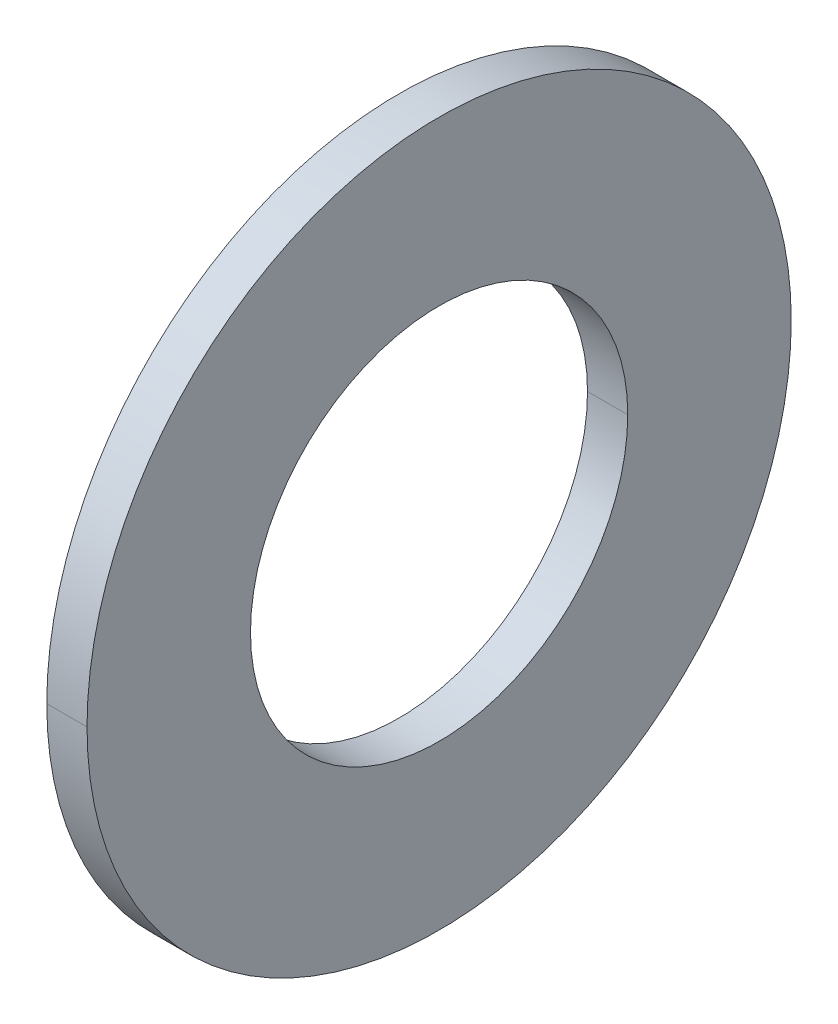
ISO-10303-21;
HEADER;
FILE_DESCRIPTION(('STEP AP214'),'2;1');
FILE_NAME('part.step','',(''),(''),'','','');
FILE_SCHEMA(('AUTOMOTIVE_DESIGN { 1 0 10303 214 1 1 1 1 }'));
ENDSEC;
DATA;
#1=APPLICATION_CONTEXT('core data for automotive mechanical design processes');
#2=APPLICATION_PROTOCOL_DEFINITION('international standard','automotive_design',2000,#1);
#3=PRODUCT_CONTEXT('',#1,'mechanical');
#4=PRODUCT('Part','Part','',(#3));
#5=PRODUCT_RELATED_PRODUCT_CATEGORY('part','',(#4));
#6=PRODUCT_DEFINITION_FORMATION('','',#4);
#7=PRODUCT_DEFINITION_CONTEXT('part definition',#1,'design');
#8=PRODUCT_DEFINITION('design','',#6,#7);
#9=PRODUCT_DEFINITION_SHAPE('','',#8);
#10=(LENGTH_UNIT() NAMED_UNIT(*) SI_UNIT(.MILLI.,.METRE.));
#11=(NAMED_UNIT(*) PLANE_ANGLE_UNIT() SI_UNIT($,.RADIAN.));
#12=(NAMED_UNIT(*) SI_UNIT($,.STERADIAN.) SOLID_ANGLE_UNIT());
#13=UNCERTAINTY_MEASURE_WITH_UNIT(LENGTH_MEASURE(1.E-05),#10,'distance_accuracy_value','');
#14=(GEOMETRIC_REPRESENTATION_CONTEXT(3) GLOBAL_UNCERTAINTY_ASSIGNED_CONTEXT((#13)) GLOBAL_UNIT_ASSIGNED_CONTEXT((#10,
#11,#12)) REPRESENTATION_CONTEXT('',''));
#15=CARTESIAN_POINT('',(0.,0.,0.));
#16=DIRECTION('',(0.,0.,1.));
#17=DIRECTION('',(1.,0.,0.));
#18=AXIS2_PLACEMENT_3D('',#15,#16,#17);
#19=CARTESIAN_POINT('',(0.8,0.,0.));
#20=DIRECTION('',(-1.,0.,0.));
#21=DIRECTION('',(0.,1.,0.));
#22=AXIS2_PLACEMENT_3D('',#19,#20,#21);
#23=CYLINDRICAL_SURFACE('',#22,7.5);
#24=DIRECTION('',(-1.,0.,0.));
#25=VECTOR('',#24,1.);
#26=CARTESIAN_POINT('',(0.8,0.,-7.5));
#27=LINE('',#26,#25);
#28=CARTESIAN_POINT('',(0.8,0.,-7.5));
#29=VERTEX_POINT('',#28);
#30=CARTESIAN_POINT('',(-0.8,0.,-7.5));
#31=VERTEX_POINT('',#30);
#32=EDGE_CURVE('E11',#29,#31,#27,.T.);
#33=ORIENTED_EDGE('',*,*,#32,.T.);
#34=CARTESIAN_POINT('',(-0.8,0.,0.));
#35=DIRECTION('',(1.,0.,0.));
#36=DIRECTION('',(0.,0.,-1.));
#37=AXIS2_PLACEMENT_3D('',#34,#35,#36);
#38=CIRCLE('',#37,7.5);
#39=CARTESIAN_POINT('',(-0.8,0.,7.5));
#40=VERTEX_POINT('',#39);
#41=EDGE_CURVE('E28',#40,#31,#38,.T.);
#42=ORIENTED_EDGE('',*,*,#41,.F.);
#43=DIRECTION('',(-1.,0.,0.));
#44=VECTOR('',#43,1.);
#45=CARTESIAN_POINT('',(0.8,0.,7.5));
#46=LINE('',#45,#44);
#47=CARTESIAN_POINT('',(0.8,0.,7.5));
#48=VERTEX_POINT('',#47);
#49=EDGE_CURVE('E116',#48,#40,#46,.T.);
#50=ORIENTED_EDGE('',*,*,#49,.F.);
#51=CARTESIAN_POINT('',(0.8,0.,0.));
#52=DIRECTION('',(1.,0.,0.));
#53=DIRECTION('',(0.,0.,-1.));
#54=AXIS2_PLACEMENT_3D('',#51,#52,#53);
#55=CIRCLE('',#54,7.5);
#56=EDGE_CURVE('E111',#48,#29,#55,.T.);
#57=ORIENTED_EDGE('',*,*,#56,.T.);
#58=EDGE_LOOP('',(#33,#42,#50,#57));
#59=FACE_BOUND('',#58,.T.);
#60=ADVANCED_FACE('F19',(#59),#23,.F.);
#61=CARTESIAN_POINT('',(0.8,0.,0.));
#62=DIRECTION('',(1.,0.,0.));
#63=DIRECTION('',(0.,0.,-1.));
#64=AXIS2_PLACEMENT_3D('',#61,#62,#63);
#65=PLANE('',#64);
#66=ORIENTED_EDGE('',*,*,#56,.F.);
#67=CARTESIAN_POINT('',(0.8,0.,0.));
#68=DIRECTION('',(1.,0.,0.));
#69=DIRECTION('',(0.,0.,-1.));
#70=AXIS2_PLACEMENT_3D('',#67,#68,#69);
#71=CIRCLE('',#70,7.5);
#72=EDGE_CURVE('E105',#29,#48,#71,.T.);
#73=ORIENTED_EDGE('',*,*,#72,.F.);
#74=EDGE_LOOP('',(#66,#73));
#75=FACE_BOUND('',#74,.T.);
#76=CARTESIAN_POINT('',(0.8,0.,0.));
#77=DIRECTION('',(1.,0.,0.));
#78=DIRECTION('',(0.,0.,-1.));
#79=AXIS2_PLACEMENT_3D('',#76,#77,#78);
#80=CIRCLE('',#79,14.);
#81=CARTESIAN_POINT('',(0.8,0.,-14.));
#82=VERTEX_POINT('',#81);
#83=CARTESIAN_POINT('',(0.8,0.,14.));
#84=VERTEX_POINT('',#83);
#85=EDGE_CURVE('E86',#82,#84,#80,.T.);
#86=ORIENTED_EDGE('',*,*,#85,.T.);
#87=CARTESIAN_POINT('',(0.8,0.,0.));
#88=DIRECTION('',(1.,0.,0.));
#89=DIRECTION('',(0.,0.,-1.));
#90=AXIS2_PLACEMENT_3D('',#87,#88,#89);
#91=CIRCLE('',#90,14.);
#92=EDGE_CURVE('E88',#84,#82,#91,.T.);
#93=ORIENTED_EDGE('',*,*,#92,.T.);
#94=EDGE_LOOP('',(#86,#93));
#95=FACE_BOUND('',#94,.T.);
#96=ADVANCED_FACE('F142',(#75,#95),#65,.T.);
#97=CARTESIAN_POINT('',(0.8,0.,0.));
#98=DIRECTION('',(-1.,0.,0.));
#99=DIRECTION('',(0.,1.,0.));
#100=AXIS2_PLACEMENT_3D('',#97,#98,#99);
#101=CYLINDRICAL_SURFACE('',#100,14.);
#102=DIRECTION('',(-1.,0.,0.));
#103=VECTOR('',#102,1.);
#104=CARTESIAN_POINT('',(0.8,0.,-14.));
#105=LINE('',#104,#103);
#106=CARTESIAN_POINT('',(-0.8,0.,-14.));
#107=VERTEX_POINT('',#106);
#108=EDGE_CURVE('E71',#82,#107,#105,.T.);
#109=ORIENTED_EDGE('',*,*,#108,.F.);
#110=ORIENTED_EDGE('',*,*,#92,.F.);
#111=DIRECTION('',(-1.,0.,0.));
#112=VECTOR('',#111,1.);
#113=CARTESIAN_POINT('',(0.8,0.,14.));
#114=LINE('',#113,#112);
#115=CARTESIAN_POINT('',(-0.8,0.,14.));
#116=VERTEX_POINT('',#115);
#117=EDGE_CURVE('E73',#84,#116,#114,.T.);
#118=ORIENTED_EDGE('',*,*,#117,.T.);
#119=CARTESIAN_POINT('',(-0.8,0.,0.));
#120=DIRECTION('',(1.,0.,0.));
#121=DIRECTION('',(0.,0.,-1.));
#122=AXIS2_PLACEMENT_3D('',#119,#120,#121);
#123=CIRCLE('',#122,14.);
#124=EDGE_CURVE('E66',#116,#107,#123,.T.);
#125=ORIENTED_EDGE('',*,*,#124,.T.);
#126=EDGE_LOOP('',(#109,#110,#118,#125));
#127=FACE_BOUND('',#126,.T.);
#128=ADVANCED_FACE('F68',(#127),#101,.T.);
#129=CARTESIAN_POINT('',(-0.8,0.,0.));
#130=DIRECTION('',(1.,0.,0.));
#131=DIRECTION('',(0.,0.,-1.));
#132=AXIS2_PLACEMENT_3D('',#129,#130,#131);
#133=PLANE('',#132);
#134=CARTESIAN_POINT('',(-0.8,0.,0.));
#135=DIRECTION('',(1.,0.,0.));
#136=DIRECTION('',(0.,0.,-1.));
#137=AXIS2_PLACEMENT_3D('',#134,#135,#136);
#138=CIRCLE('',#137,7.5);
#139=EDGE_CURVE('E77',#31,#40,#138,.T.);
#140=ORIENTED_EDGE('',*,*,#139,.T.);
#141=ORIENTED_EDGE('',*,*,#41,.T.);
#142=EDGE_LOOP('',(#140,#141));
#143=FACE_BOUND('',#142,.T.);
#144=ORIENTED_EDGE('',*,*,#124,.F.);
#145=CARTESIAN_POINT('',(-0.8,0.,0.));
#146=DIRECTION('',(1.,0.,0.));
#147=DIRECTION('',(0.,0.,-1.));
#148=AXIS2_PLACEMENT_3D('',#145,#146,#147);
#149=CIRCLE('',#148,14.);
#150=EDGE_CURVE('E79',#107,#116,#149,.T.);
#151=ORIENTED_EDGE('',*,*,#150,.F.);
#152=EDGE_LOOP('',(#144,#151));
#153=FACE_BOUND('',#152,.T.);
#154=ADVANCED_FACE('F80',(#143,#153),#133,.F.);
#155=CARTESIAN_POINT('',(0.8,0.,0.));
#156=DIRECTION('',(-1.,0.,0.));
#157=DIRECTION('',(0.,-1.,0.));
#158=AXIS2_PLACEMENT_3D('',#155,#156,#157);
#159=CYLINDRICAL_SURFACE('',#158,14.);
#160=ORIENTED_EDGE('',*,*,#108,.T.);
#161=ORIENTED_EDGE('',*,*,#150,.T.);
#162=ORIENTED_EDGE('',*,*,#117,.F.);
#163=ORIENTED_EDGE('',*,*,#85,.F.);
#164=EDGE_LOOP('',(#160,#161,#162,#163));
#165=FACE_BOUND('',#164,.T.);
#166=ADVANCED_FACE('F85',(#165),#159,.T.);
#167=CARTESIAN_POINT('',(0.8,0.,0.));
#168=DIRECTION('',(-1.,0.,0.));
#169=DIRECTION('',(0.,-1.,0.));
#170=AXIS2_PLACEMENT_3D('',#167,#168,#169);
#171=CYLINDRICAL_SURFACE('',#170,7.5);
#172=ORIENTED_EDGE('',*,*,#32,.F.);
#173=ORIENTED_EDGE('',*,*,#72,.T.);
#174=ORIENTED_EDGE('',*,*,#49,.T.);
#175=ORIENTED_EDGE('',*,*,#139,.F.);
#176=EDGE_LOOP('',(#172,#173,#174,#175));
#177=FACE_BOUND('',#176,.T.);
#178=ADVANCED_FACE('F138',(#177),#171,.F.);
#179=CLOSED_SHELL('',(#60,#96,#128,#154,#166,#178));
#180=MANIFOLD_SOLID_BREP('B1',#179);
#181=ADVANCED_BREP_SHAPE_REPRESENTATION('',(#18,#180),#14);
#182=SHAPE_DEFINITION_REPRESENTATION(#9,#181);
ENDSEC;
END-ISO-10303-21;
